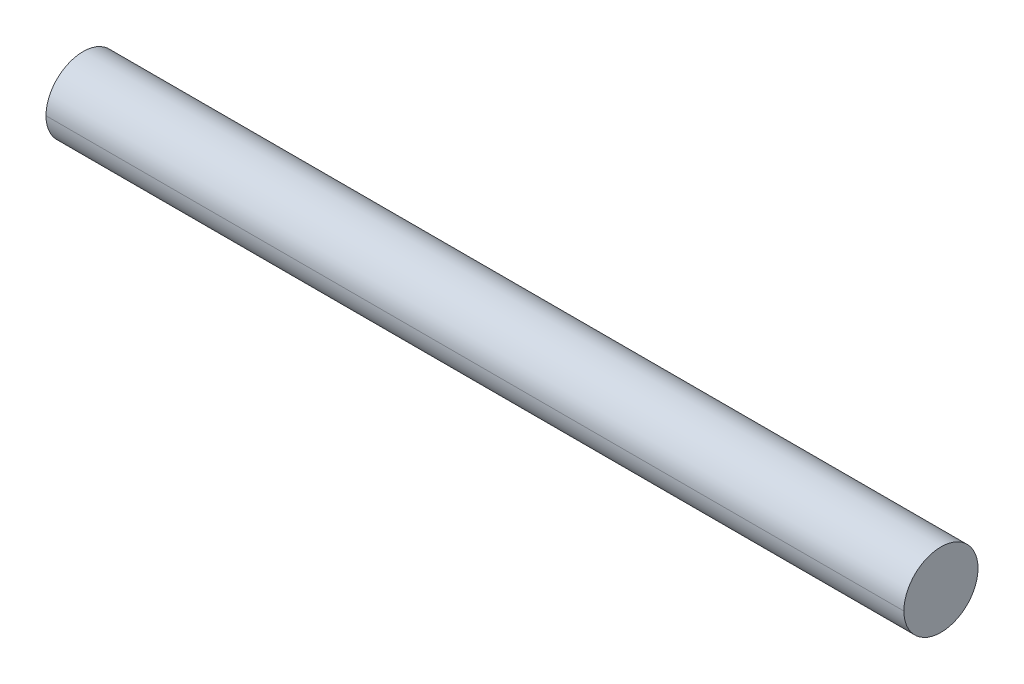
ISO-10303-21;
HEADER;
FILE_DESCRIPTION(('STEP AP214'),'2;1');
FILE_NAME('part.step','',(''),(''),'','','');
FILE_SCHEMA(('AUTOMOTIVE_DESIGN { 1 0 10303 214 1 1 1 1 }'));
ENDSEC;
DATA;
#1=APPLICATION_CONTEXT('core data for automotive mechanical design processes');
#2=APPLICATION_PROTOCOL_DEFINITION('international standard','automotive_design',2000,#1);
#3=PRODUCT_CONTEXT('',#1,'mechanical');
#4=PRODUCT('Part','Part','',(#3));
#5=PRODUCT_RELATED_PRODUCT_CATEGORY('part','',(#4));
#6=PRODUCT_DEFINITION_FORMATION('','',#4);
#7=PRODUCT_DEFINITION_CONTEXT('part definition',#1,'design');
#8=PRODUCT_DEFINITION('design','',#6,#7);
#9=PRODUCT_DEFINITION_SHAPE('','',#8);
#10=(LENGTH_UNIT() NAMED_UNIT(*) SI_UNIT(.MILLI.,.METRE.));
#11=(NAMED_UNIT(*) PLANE_ANGLE_UNIT() SI_UNIT($,.RADIAN.));
#12=(NAMED_UNIT(*) SI_UNIT($,.STERADIAN.) SOLID_ANGLE_UNIT());
#13=UNCERTAINTY_MEASURE_WITH_UNIT(LENGTH_MEASURE(1.E-05),#10,'distance_accuracy_value','');
#14=(GEOMETRIC_REPRESENTATION_CONTEXT(3) GLOBAL_UNCERTAINTY_ASSIGNED_CONTEXT((#13)) GLOBAL_UNIT_ASSIGNED_CONTEXT((#10,
#11,#12)) REPRESENTATION_CONTEXT('',''));
#15=CARTESIAN_POINT('',(0.,0.,0.));
#16=DIRECTION('',(0.,0.,1.));
#17=DIRECTION('',(1.,0.,0.));
#18=AXIS2_PLACEMENT_3D('',#15,#16,#17);
#19=CARTESIAN_POINT('',(0.,0.,0.));
#20=DIRECTION('',(1.,0.,0.));
#21=DIRECTION('',(0.,1.,0.));
#22=AXIS2_PLACEMENT_3D('',#19,#20,#21);
#23=PLANE('',#22);
#24=CARTESIAN_POINT('',(0.,0.,0.));
#25=DIRECTION('',(1.,0.,0.));
#26=DIRECTION('',(0.,0.,-1.));
#27=AXIS2_PLACEMENT_3D('',#24,#25,#26);
#28=CIRCLE('',#27,19.05);
#29=CARTESIAN_POINT('',(0.,0.,19.05));
#30=VERTEX_POINT('',#29);
#31=CARTESIAN_POINT('',(0.,0.,-19.05));
#32=VERTEX_POINT('',#31);
#33=EDGE_CURVE('E11',#30,#32,#28,.T.);
#34=ORIENTED_EDGE('',*,*,#33,.F.);
#35=CARTESIAN_POINT('',(0.,0.,0.));
#36=DIRECTION('',(1.,0.,0.));
#37=DIRECTION('',(0.,0.,-1.));
#38=AXIS2_PLACEMENT_3D('',#35,#36,#37);
#39=CIRCLE('',#38,19.05);
#40=EDGE_CURVE('E65',#32,#30,#39,.T.);
#41=ORIENTED_EDGE('',*,*,#40,.F.);
#42=EDGE_LOOP('',(#34,#41));
#43=FACE_BOUND('',#42,.T.);
#44=ADVANCED_FACE('F16',(#43),#23,.F.);
#45=CARTESIAN_POINT('',(440.944,0.,0.));
#46=DIRECTION('',(1.,0.,0.));
#47=DIRECTION('',(0.,1.,0.));
#48=AXIS2_PLACEMENT_3D('',#45,#46,#47);
#49=PLANE('',#48);
#50=CARTESIAN_POINT('',(440.944,0.,0.));
#51=DIRECTION('',(1.,0.,0.));
#52=DIRECTION('',(0.,0.,-1.));
#53=AXIS2_PLACEMENT_3D('',#50,#51,#52);
#54=CIRCLE('',#53,19.05);
#55=CARTESIAN_POINT('',(440.944,0.,19.05));
#56=VERTEX_POINT('',#55);
#57=CARTESIAN_POINT('',(440.944,0.,-19.05));
#58=VERTEX_POINT('',#57);
#59=EDGE_CURVE('E20',#56,#58,#54,.T.);
#60=ORIENTED_EDGE('',*,*,#59,.T.);
#61=CARTESIAN_POINT('',(440.944,0.,0.));
#62=DIRECTION('',(1.,0.,0.));
#63=DIRECTION('',(0.,0.,-1.));
#64=AXIS2_PLACEMENT_3D('',#61,#62,#63);
#65=CIRCLE('',#64,19.05);
#66=EDGE_CURVE('E56',#58,#56,#65,.T.);
#67=ORIENTED_EDGE('',*,*,#66,.T.);
#68=EDGE_LOOP('',(#60,#67));
#69=FACE_BOUND('',#68,.T.);
#70=ADVANCED_FACE('F54',(#69),#49,.T.);
#71=CARTESIAN_POINT('',(440.944,0.,0.));
#72=DIRECTION('',(-1.,0.,0.));
#73=DIRECTION('',(0.,0.,1.));
#74=AXIS2_PLACEMENT_3D('',#71,#72,#73);
#75=CYLINDRICAL_SURFACE('',#74,19.05);
#76=DIRECTION('',(-1.,0.,0.));
#77=VECTOR('',#76,1.);
#78=CARTESIAN_POINT('',(440.944,0.,-19.05));
#79=LINE('',#78,#77);
#80=EDGE_CURVE('E61',#58,#32,#79,.T.);
#81=ORIENTED_EDGE('',*,*,#80,.F.);
#82=ORIENTED_EDGE('',*,*,#59,.F.);
#83=DIRECTION('',(-1.,0.,0.));
#84=VECTOR('',#83,1.);
#85=CARTESIAN_POINT('',(440.944,0.,19.05));
#86=LINE('',#85,#84);
#87=EDGE_CURVE('E59',#56,#30,#86,.T.);
#88=ORIENTED_EDGE('',*,*,#87,.T.);
#89=ORIENTED_EDGE('',*,*,#33,.T.);
#90=EDGE_LOOP('',(#81,#82,#88,#89));
#91=FACE_BOUND('',#90,.T.);
#92=ADVANCED_FACE('F18',(#91),#75,.T.);
#93=CARTESIAN_POINT('',(440.944,0.,0.));
#94=DIRECTION('',(-1.,0.,0.));
#95=DIRECTION('',(0.,0.,1.));
#96=AXIS2_PLACEMENT_3D('',#93,#94,#95);
#97=CYLINDRICAL_SURFACE('',#96,19.05);
#98=ORIENTED_EDGE('',*,*,#66,.F.);
#99=ORIENTED_EDGE('',*,*,#80,.T.);
#100=ORIENTED_EDGE('',*,*,#40,.T.);
#101=ORIENTED_EDGE('',*,*,#87,.F.);
#102=EDGE_LOOP('',(#98,#99,#100,#101));
#103=FACE_BOUND('',#102,.T.);
#104=ADVANCED_FACE('F67',(#103),#97,.T.);
#105=CLOSED_SHELL('',(#44,#70,#92,#104));
#106=MANIFOLD_SOLID_BREP('B1',#105);
#107=ADVANCED_BREP_SHAPE_REPRESENTATION('',(#18,#106),#14);
#108=SHAPE_DEFINITION_REPRESENTATION(#9,#107);
ENDSEC;
END-ISO-10303-21;
